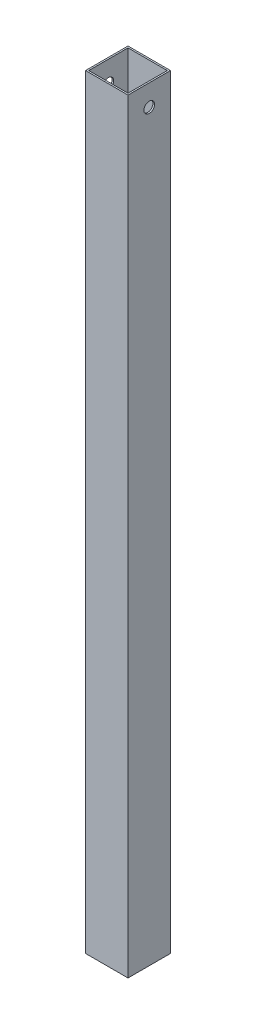
ISO-10303-21;
HEADER;
FILE_DESCRIPTION(('STEP AP214'),'2;1');
FILE_NAME('part.step','',(''),(''),'','','');
FILE_SCHEMA(('AUTOMOTIVE_DESIGN { 1 0 10303 214 1 1 1 1 }'));
ENDSEC;
DATA;
#1=APPLICATION_CONTEXT('core data for automotive mechanical design processes');
#2=APPLICATION_PROTOCOL_DEFINITION('international standard','automotive_design',2000,#1);
#3=PRODUCT_CONTEXT('',#1,'mechanical');
#4=PRODUCT('Part','Part','',(#3));
#5=PRODUCT_RELATED_PRODUCT_CATEGORY('part','',(#4));
#6=PRODUCT_DEFINITION_FORMATION('','',#4);
#7=PRODUCT_DEFINITION_CONTEXT('part definition',#1,'design');
#8=PRODUCT_DEFINITION('design','',#6,#7);
#9=PRODUCT_DEFINITION_SHAPE('','',#8);
#10=(LENGTH_UNIT() NAMED_UNIT(*) SI_UNIT(.MILLI.,.METRE.));
#11=(NAMED_UNIT(*) PLANE_ANGLE_UNIT() SI_UNIT($,.RADIAN.));
#12=(NAMED_UNIT(*) SI_UNIT($,.STERADIAN.) SOLID_ANGLE_UNIT());
#13=UNCERTAINTY_MEASURE_WITH_UNIT(LENGTH_MEASURE(1.E-05),#10,'distance_accuracy_value','');
#14=(GEOMETRIC_REPRESENTATION_CONTEXT(3) GLOBAL_UNCERTAINTY_ASSIGNED_CONTEXT((#13)) GLOBAL_UNIT_ASSIGNED_CONTEXT((#10,
#11,#12)) REPRESENTATION_CONTEXT('',''));
#15=CARTESIAN_POINT('',(0.,0.,0.));
#16=DIRECTION('',(0.,0.,1.));
#17=DIRECTION('',(1.,0.,0.));
#18=AXIS2_PLACEMENT_3D('',#15,#16,#17);
#19=CARTESIAN_POINT('',(0.,457.2,0.));
#20=DIRECTION('',(0.,1.,0.));
#21=DIRECTION('',(0.,0.,1.));
#22=AXIS2_PLACEMENT_3D('',#19,#20,#21);
#23=PLANE('',#22);
#24=DIRECTION('',(0.,0.,-1.));
#25=VECTOR('',#24,1.);
#26=CARTESIAN_POINT('',(12.7,457.2,-12.7));
#27=LINE('',#26,#25);
#28=CARTESIAN_POINT('',(12.7,457.2,12.7));
#29=VERTEX_POINT('',#28);
#30=CARTESIAN_POINT('',(12.7,457.2,-12.7));
#31=VERTEX_POINT('',#30);
#32=EDGE_CURVE('E139',#29,#31,#27,.T.);
#33=ORIENTED_EDGE('',*,*,#32,.T.);
#34=DIRECTION('',(-1.,0.,0.));
#35=VECTOR('',#34,1.);
#36=CARTESIAN_POINT('',(-12.7,457.2,-12.7));
#37=LINE('',#36,#35);
#38=CARTESIAN_POINT('',(-12.7,457.2,-12.7));
#39=VERTEX_POINT('',#38);
#40=EDGE_CURVE('E142',#31,#39,#37,.T.);
#41=ORIENTED_EDGE('',*,*,#40,.T.);
#42=DIRECTION('',(0.,0.,1.));
#43=VECTOR('',#42,1.);
#44=CARTESIAN_POINT('',(-12.7,457.2,-12.7));
#45=LINE('',#44,#43);
#46=CARTESIAN_POINT('',(-12.7,457.2,12.7));
#47=VERTEX_POINT('',#46);
#48=EDGE_CURVE('E145',#39,#47,#45,.T.);
#49=ORIENTED_EDGE('',*,*,#48,.T.);
#50=DIRECTION('',(1.,0.,0.));
#51=VECTOR('',#50,1.);
#52=CARTESIAN_POINT('',(-12.7,457.2,12.7));
#53=LINE('',#52,#51);
#54=EDGE_CURVE('E147',#47,#29,#53,.T.);
#55=ORIENTED_EDGE('',*,*,#54,.T.);
#56=EDGE_LOOP('',(#33,#41,#49,#55));
#57=FACE_BOUND('',#56,.T.);
#58=DIRECTION('',(1.,0.,0.));
#59=VECTOR('',#58,1.);
#60=CARTESIAN_POINT('',(-11.7348,457.2,11.7348));
#61=LINE('',#60,#59);
#62=CARTESIAN_POINT('',(-11.7348,457.2,11.7348));
#63=VERTEX_POINT('',#62);
#64=CARTESIAN_POINT('',(11.7348,457.2,11.7348));
#65=VERTEX_POINT('',#64);
#66=EDGE_CURVE('E109',#63,#65,#61,.T.);
#67=ORIENTED_EDGE('',*,*,#66,.F.);
#68=DIRECTION('',(0.,0.,1.));
#69=VECTOR('',#68,1.);
#70=CARTESIAN_POINT('',(-11.7348,457.2,-11.7348));
#71=LINE('',#70,#69);
#72=CARTESIAN_POINT('',(-11.7348,457.2,-11.7348));
#73=VERTEX_POINT('',#72);
#74=EDGE_CURVE('E101',#73,#63,#71,.T.);
#75=ORIENTED_EDGE('',*,*,#74,.F.);
#76=DIRECTION('',(-1.,0.,0.));
#77=VECTOR('',#76,1.);
#78=CARTESIAN_POINT('',(-11.7348,457.2,-11.7348));
#79=LINE('',#78,#77);
#80=CARTESIAN_POINT('',(11.7348,457.2,-11.7348));
#81=VERTEX_POINT('',#80);
#82=EDGE_CURVE('E123',#81,#73,#79,.T.);
#83=ORIENTED_EDGE('',*,*,#82,.F.);
#84=DIRECTION('',(0.,0.,-1.));
#85=VECTOR('',#84,1.);
#86=CARTESIAN_POINT('',(11.7348,457.2,-11.7348));
#87=LINE('',#86,#85);
#88=EDGE_CURVE('E121',#65,#81,#87,.T.);
#89=ORIENTED_EDGE('',*,*,#88,.F.);
#90=EDGE_LOOP('',(#67,#75,#83,#89));
#91=FACE_BOUND('',#90,.T.);
#92=ADVANCED_FACE('F35',(#57,#91),#23,.T.);
#93=CARTESIAN_POINT('',(0.,0.,0.));
#94=DIRECTION('',(0.,1.,0.));
#95=DIRECTION('',(0.,0.,1.));
#96=AXIS2_PLACEMENT_3D('',#93,#94,#95);
#97=PLANE('',#96);
#98=DIRECTION('',(0.,0.,-1.));
#99=VECTOR('',#98,1.);
#100=CARTESIAN_POINT('',(12.7,0.,-12.7));
#101=LINE('',#100,#99);
#102=CARTESIAN_POINT('',(12.7,0.,12.7));
#103=VERTEX_POINT('',#102);
#104=CARTESIAN_POINT('',(12.7,0.,-12.7));
#105=VERTEX_POINT('',#104);
#106=EDGE_CURVE('E117',#103,#105,#101,.T.);
#107=ORIENTED_EDGE('',*,*,#106,.F.);
#108=DIRECTION('',(1.,0.,0.));
#109=VECTOR('',#108,1.);
#110=CARTESIAN_POINT('',(-12.7,0.,12.7));
#111=LINE('',#110,#109);
#112=CARTESIAN_POINT('',(-12.7,0.,12.7));
#113=VERTEX_POINT('',#112);
#114=EDGE_CURVE('E143',#113,#103,#111,.T.);
#115=ORIENTED_EDGE('',*,*,#114,.F.);
#116=DIRECTION('',(0.,0.,1.));
#117=VECTOR('',#116,1.);
#118=CARTESIAN_POINT('',(-12.7,0.,-12.7));
#119=LINE('',#118,#117);
#120=CARTESIAN_POINT('',(-12.7,0.,-12.7));
#121=VERTEX_POINT('',#120);
#122=EDGE_CURVE('E154',#121,#113,#119,.T.);
#123=ORIENTED_EDGE('',*,*,#122,.F.);
#124=DIRECTION('',(-1.,0.,0.));
#125=VECTOR('',#124,1.);
#126=CARTESIAN_POINT('',(-12.7,0.,-12.7));
#127=LINE('',#126,#125);
#128=EDGE_CURVE('E152',#105,#121,#127,.T.);
#129=ORIENTED_EDGE('',*,*,#128,.F.);
#130=EDGE_LOOP('',(#107,#115,#123,#129));
#131=FACE_BOUND('',#130,.T.);
#132=DIRECTION('',(0.,0.,1.));
#133=VECTOR('',#132,1.);
#134=CARTESIAN_POINT('',(-11.7348,0.,-11.7348));
#135=LINE('',#134,#133);
#136=CARTESIAN_POINT('',(-11.7348,0.,-11.7348));
#137=VERTEX_POINT('',#136);
#138=CARTESIAN_POINT('',(-11.7348,0.,11.7348));
#139=VERTEX_POINT('',#138);
#140=EDGE_CURVE('E59',#137,#139,#135,.T.);
#141=ORIENTED_EDGE('',*,*,#140,.T.);
#142=DIRECTION('',(1.,0.,0.));
#143=VECTOR('',#142,1.);
#144=CARTESIAN_POINT('',(-11.7348,0.,11.7348));
#145=LINE('',#144,#143);
#146=CARTESIAN_POINT('',(11.7348,0.,11.7348));
#147=VERTEX_POINT('',#146);
#148=EDGE_CURVE('E116',#139,#147,#145,.T.);
#149=ORIENTED_EDGE('',*,*,#148,.T.);
#150=DIRECTION('',(0.,0.,-1.));
#151=VECTOR('',#150,1.);
#152=CARTESIAN_POINT('',(11.7348,0.,-11.7348));
#153=LINE('',#152,#151);
#154=CARTESIAN_POINT('',(11.7348,0.,-11.7348));
#155=VERTEX_POINT('',#154);
#156=EDGE_CURVE('E131',#147,#155,#153,.T.);
#157=ORIENTED_EDGE('',*,*,#156,.T.);
#158=DIRECTION('',(-1.,0.,0.));
#159=VECTOR('',#158,1.);
#160=CARTESIAN_POINT('',(-11.7348,0.,-11.7348));
#161=LINE('',#160,#159);
#162=EDGE_CURVE('E110',#155,#137,#161,.T.);
#163=ORIENTED_EDGE('',*,*,#162,.T.);
#164=EDGE_LOOP('',(#141,#149,#157,#163));
#165=FACE_BOUND('',#164,.T.);
#166=ADVANCED_FACE('F173',(#131,#165),#97,.F.);
#167=CARTESIAN_POINT('',(12.7,457.2,-12.7));
#168=DIRECTION('',(-1.,0.,0.));
#169=DIRECTION('',(0.,0.,1.));
#170=AXIS2_PLACEMENT_3D('',#167,#168,#169);
#171=PLANE('',#170);
#172=CARTESIAN_POINT('',(12.7,444.5,0.));
#173=DIRECTION('',(1.,0.,0.));
#174=DIRECTION('',(0.,0.,-1.));
#175=AXIS2_PLACEMENT_3D('',#172,#173,#174);
#176=CIRCLE('',#175,3.175);
#177=CARTESIAN_POINT('',(12.7,444.5,-3.175));
#178=VERTEX_POINT('',#177);
#179=EDGE_CURVE('E216',#178,#178,#176,.T.);
#180=ORIENTED_EDGE('',*,*,#179,.F.);
#181=EDGE_LOOP('',(#180));
#182=FACE_BOUND('',#181,.T.);
#183=ORIENTED_EDGE('',*,*,#106,.T.);
#184=DIRECTION('',(0.,-1.,0.));
#185=VECTOR('',#184,1.);
#186=CARTESIAN_POINT('',(12.7,457.2,-12.7));
#187=LINE('',#186,#185);
#188=EDGE_CURVE('E11',#31,#105,#187,.T.);
#189=ORIENTED_EDGE('',*,*,#188,.F.);
#190=ORIENTED_EDGE('',*,*,#32,.F.);
#191=DIRECTION('',(0.,-1.,0.));
#192=VECTOR('',#191,1.);
#193=CARTESIAN_POINT('',(12.7,457.2,12.7));
#194=LINE('',#193,#192);
#195=EDGE_CURVE('E149',#29,#103,#194,.T.);
#196=ORIENTED_EDGE('',*,*,#195,.T.);
#197=EDGE_LOOP('',(#183,#189,#190,#196));
#198=FACE_BOUND('',#197,.T.);
#199=ADVANCED_FACE('F37',(#182,#198),#171,.F.);
#200=CARTESIAN_POINT('',(-12.7,457.2,-12.7));
#201=DIRECTION('',(0.,0.,1.));
#202=DIRECTION('',(1.,0.,0.));
#203=AXIS2_PLACEMENT_3D('',#200,#201,#202);
#204=PLANE('',#203);
#205=ORIENTED_EDGE('',*,*,#128,.T.);
#206=DIRECTION('',(0.,-1.,0.));
#207=VECTOR('',#206,1.);
#208=CARTESIAN_POINT('',(-12.7,457.2,-12.7));
#209=LINE('',#208,#207);
#210=EDGE_CURVE('E44',#39,#121,#209,.T.);
#211=ORIENTED_EDGE('',*,*,#210,.F.);
#212=ORIENTED_EDGE('',*,*,#40,.F.);
#213=ORIENTED_EDGE('',*,*,#188,.T.);
#214=EDGE_LOOP('',(#205,#211,#212,#213));
#215=FACE_BOUND('',#214,.T.);
#216=ADVANCED_FACE('F183',(#215),#204,.F.);
#217=CARTESIAN_POINT('',(-12.7,457.2,-12.7));
#218=DIRECTION('',(1.,0.,0.));
#219=DIRECTION('',(0.,0.,-1.));
#220=AXIS2_PLACEMENT_3D('',#217,#218,#219);
#221=PLANE('',#220);
#222=CARTESIAN_POINT('',(-12.7,444.5,0.));
#223=DIRECTION('',(1.,0.,0.));
#224=DIRECTION('',(0.,0.,-1.));
#225=AXIS2_PLACEMENT_3D('',#222,#223,#224);
#226=CIRCLE('',#225,3.175);
#227=CARTESIAN_POINT('',(-12.7,444.5,-3.175));
#228=VERTEX_POINT('',#227);
#229=EDGE_CURVE('E214',#228,#228,#226,.T.);
#230=ORIENTED_EDGE('',*,*,#229,.T.);
#231=EDGE_LOOP('',(#230));
#232=FACE_BOUND('',#231,.T.);
#233=ORIENTED_EDGE('',*,*,#122,.T.);
#234=DIRECTION('',(0.,-1.,0.));
#235=VECTOR('',#234,1.);
#236=CARTESIAN_POINT('',(-12.7,457.2,12.7));
#237=LINE('',#236,#235);
#238=EDGE_CURVE('E159',#47,#113,#237,.T.);
#239=ORIENTED_EDGE('',*,*,#238,.F.);
#240=ORIENTED_EDGE('',*,*,#48,.F.);
#241=ORIENTED_EDGE('',*,*,#210,.T.);
#242=EDGE_LOOP('',(#233,#239,#240,#241));
#243=FACE_BOUND('',#242,.T.);
#244=ADVANCED_FACE('F167',(#232,#243),#221,.F.);
#245=CARTESIAN_POINT('',(-12.7,457.2,12.7));
#246=DIRECTION('',(0.,0.,-1.));
#247=DIRECTION('',(-1.,0.,0.));
#248=AXIS2_PLACEMENT_3D('',#245,#246,#247);
#249=PLANE('',#248);
#250=ORIENTED_EDGE('',*,*,#114,.T.);
#251=ORIENTED_EDGE('',*,*,#195,.F.);
#252=ORIENTED_EDGE('',*,*,#54,.F.);
#253=ORIENTED_EDGE('',*,*,#238,.T.);
#254=EDGE_LOOP('',(#250,#251,#252,#253));
#255=FACE_BOUND('',#254,.T.);
#256=ADVANCED_FACE('F177',(#255),#249,.F.);
#257=CARTESIAN_POINT('',(-11.7348,457.2,-11.7348));
#258=DIRECTION('',(1.,0.,0.));
#259=DIRECTION('',(0.,0.,-1.));
#260=AXIS2_PLACEMENT_3D('',#257,#258,#259);
#261=PLANE('',#260);
#262=CARTESIAN_POINT('',(-11.7348,444.5,0.));
#263=DIRECTION('',(1.,0.,0.));
#264=DIRECTION('',(0.,0.,-1.));
#265=AXIS2_PLACEMENT_3D('',#262,#263,#264);
#266=CIRCLE('',#265,3.175);
#267=CARTESIAN_POINT('',(-11.7348,444.5,-3.175));
#268=VERTEX_POINT('',#267);
#269=EDGE_CURVE('E129',#268,#268,#266,.T.);
#270=ORIENTED_EDGE('',*,*,#269,.F.);
#271=EDGE_LOOP('',(#270));
#272=FACE_BOUND('',#271,.T.);
#273=ORIENTED_EDGE('',*,*,#140,.F.);
#274=DIRECTION('',(0.,-1.,0.));
#275=VECTOR('',#274,1.);
#276=CARTESIAN_POINT('',(-11.7348,457.2,-11.7348));
#277=LINE('',#276,#275);
#278=EDGE_CURVE('E105',#73,#137,#277,.T.);
#279=ORIENTED_EDGE('',*,*,#278,.F.);
#280=ORIENTED_EDGE('',*,*,#74,.T.);
#281=DIRECTION('',(0.,-1.,0.));
#282=VECTOR('',#281,1.);
#283=CARTESIAN_POINT('',(-11.7348,457.2,11.7348));
#284=LINE('',#283,#282);
#285=EDGE_CURVE('E104',#63,#139,#284,.T.);
#286=ORIENTED_EDGE('',*,*,#285,.T.);
#287=EDGE_LOOP('',(#273,#279,#280,#286));
#288=FACE_BOUND('',#287,.T.);
#289=ADVANCED_FACE('F103',(#272,#288),#261,.T.);
#290=CARTESIAN_POINT('',(-11.7348,457.2,11.7348));
#291=DIRECTION('',(0.,0.,-1.));
#292=DIRECTION('',(-1.,0.,0.));
#293=AXIS2_PLACEMENT_3D('',#290,#291,#292);
#294=PLANE('',#293);
#295=ORIENTED_EDGE('',*,*,#148,.F.);
#296=ORIENTED_EDGE('',*,*,#285,.F.);
#297=ORIENTED_EDGE('',*,*,#66,.T.);
#298=DIRECTION('',(0.,-1.,0.));
#299=VECTOR('',#298,1.);
#300=CARTESIAN_POINT('',(11.7348,457.2,11.7348));
#301=LINE('',#300,#299);
#302=EDGE_CURVE('E118',#65,#147,#301,.T.);
#303=ORIENTED_EDGE('',*,*,#302,.T.);
#304=EDGE_LOOP('',(#295,#296,#297,#303));
#305=FACE_BOUND('',#304,.T.);
#306=ADVANCED_FACE('F113',(#305),#294,.T.);
#307=CARTESIAN_POINT('',(11.7348,457.2,-11.7348));
#308=DIRECTION('',(-1.,0.,0.));
#309=DIRECTION('',(0.,0.,1.));
#310=AXIS2_PLACEMENT_3D('',#307,#308,#309);
#311=PLANE('',#310);
#312=CARTESIAN_POINT('',(11.7348,444.5,0.));
#313=DIRECTION('',(-1.,0.,0.));
#314=DIRECTION('',(0.,0.,1.));
#315=AXIS2_PLACEMENT_3D('',#312,#313,#314);
#316=CIRCLE('',#315,3.175);
#317=CARTESIAN_POINT('',(11.7348,444.5,3.175));
#318=VERTEX_POINT('',#317);
#319=EDGE_CURVE('E39',#318,#318,#316,.T.);
#320=ORIENTED_EDGE('',*,*,#319,.F.);
#321=EDGE_LOOP('',(#320));
#322=FACE_BOUND('',#321,.T.);
#323=ORIENTED_EDGE('',*,*,#156,.F.);
#324=ORIENTED_EDGE('',*,*,#302,.F.);
#325=ORIENTED_EDGE('',*,*,#88,.T.);
#326=DIRECTION('',(0.,-1.,0.));
#327=VECTOR('',#326,1.);
#328=CARTESIAN_POINT('',(11.7348,457.2,-11.7348));
#329=LINE('',#328,#327);
#330=EDGE_CURVE('E51',#81,#155,#329,.T.);
#331=ORIENTED_EDGE('',*,*,#330,.T.);
#332=EDGE_LOOP('',(#323,#324,#325,#331));
#333=FACE_BOUND('',#332,.T.);
#334=ADVANCED_FACE('F209',(#322,#333),#311,.T.);
#335=CARTESIAN_POINT('',(-11.7348,457.2,-11.7348));
#336=DIRECTION('',(0.,0.,1.));
#337=DIRECTION('',(1.,0.,0.));
#338=AXIS2_PLACEMENT_3D('',#335,#336,#337);
#339=PLANE('',#338);
#340=ORIENTED_EDGE('',*,*,#162,.F.);
#341=ORIENTED_EDGE('',*,*,#330,.F.);
#342=ORIENTED_EDGE('',*,*,#82,.T.);
#343=ORIENTED_EDGE('',*,*,#278,.T.);
#344=EDGE_LOOP('',(#340,#341,#342,#343));
#345=FACE_BOUND('',#344,.T.);
#346=ADVANCED_FACE('F229',(#345),#339,.T.);
#347=CARTESIAN_POINT('',(-12.7,444.5,0.));
#348=DIRECTION('',(1.,0.,0.));
#349=DIRECTION('',(0.,0.,-1.));
#350=AXIS2_PLACEMENT_3D('',#347,#348,#349);
#351=CYLINDRICAL_SURFACE('',#350,3.175);
#352=ORIENTED_EDGE('',*,*,#319,.T.);
#353=EDGE_LOOP('',(#352));
#354=FACE_BOUND('',#353,.T.);
#355=ORIENTED_EDGE('',*,*,#179,.T.);
#356=EDGE_LOOP('',(#355));
#357=FACE_BOUND('',#356,.T.);
#358=ADVANCED_FACE('F224',(#354,#357),#351,.F.);
#359=ORIENTED_EDGE('',*,*,#269,.T.);
#360=EDGE_LOOP('',(#359));
#361=FACE_BOUND('',#360,.T.);
#362=ORIENTED_EDGE('',*,*,#229,.F.);
#363=EDGE_LOOP('',(#362));
#364=FACE_BOUND('',#363,.T.);
#365=ADVANCED_FACE('F222',(#361,#364),#351,.F.);
#366=CLOSED_SHELL('',(#92,#166,#199,#216,#244,#256,#289,#306,#334,#346,#358,#365));
#367=MANIFOLD_SOLID_BREP('B2',#366);
#368=ADVANCED_BREP_SHAPE_REPRESENTATION('',(#18,#367),#14);
#369=SHAPE_DEFINITION_REPRESENTATION(#9,#368);
ENDSEC;
END-ISO-10303-21;
